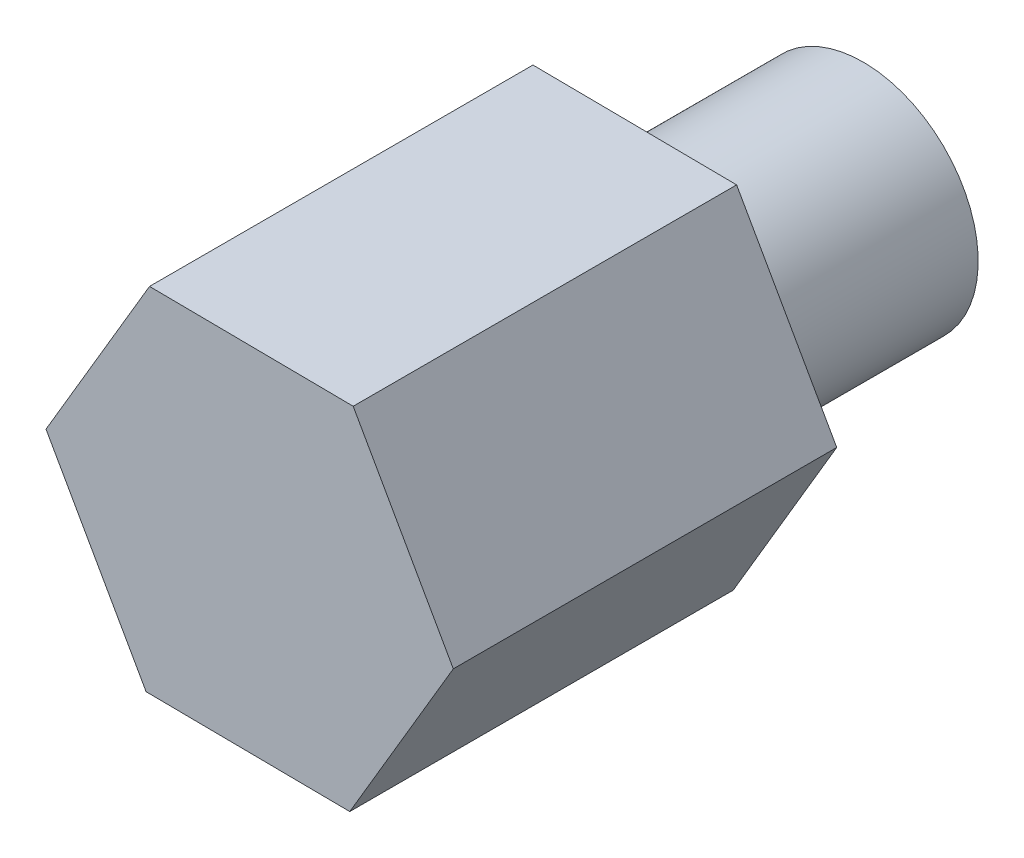
ISO-10303-21;
HEADER;
FILE_DESCRIPTION(('STEP AP214'),'2;1');
FILE_NAME('part.step','',(''),(''),'','','');
FILE_SCHEMA(('AUTOMOTIVE_DESIGN { 1 0 10303 214 1 1 1 1 }'));
ENDSEC;
DATA;
#1=APPLICATION_CONTEXT('core data for automotive mechanical design processes');
#2=APPLICATION_PROTOCOL_DEFINITION('international standard','automotive_design',2000,#1);
#3=PRODUCT_CONTEXT('',#1,'mechanical');
#4=PRODUCT('Part','Part','',(#3));
#5=PRODUCT_RELATED_PRODUCT_CATEGORY('part','',(#4));
#6=PRODUCT_DEFINITION_FORMATION('','',#4);
#7=PRODUCT_DEFINITION_CONTEXT('part definition',#1,'design');
#8=PRODUCT_DEFINITION('design','',#6,#7);
#9=PRODUCT_DEFINITION_SHAPE('','',#8);
#10=(LENGTH_UNIT() NAMED_UNIT(*) SI_UNIT(.MILLI.,.METRE.));
#11=(NAMED_UNIT(*) PLANE_ANGLE_UNIT() SI_UNIT($,.RADIAN.));
#12=(NAMED_UNIT(*) SI_UNIT($,.STERADIAN.) SOLID_ANGLE_UNIT());
#13=UNCERTAINTY_MEASURE_WITH_UNIT(LENGTH_MEASURE(1.E-05),#10,'distance_accuracy_value','');
#14=(GEOMETRIC_REPRESENTATION_CONTEXT(3) GLOBAL_UNCERTAINTY_ASSIGNED_CONTEXT((#13)) GLOBAL_UNIT_ASSIGNED_CONTEXT((#10,
#11,#12)) REPRESENTATION_CONTEXT('',''));
#15=CARTESIAN_POINT('',(0.,0.,0.));
#16=DIRECTION('',(0.,0.,1.));
#17=DIRECTION('',(1.,0.,0.));
#18=AXIS2_PLACEMENT_3D('',#15,#16,#17);
#19=CARTESIAN_POINT('',(-1.35012806829189,-2.28702591427027,5.));
#20=DIRECTION('',(0.0096890351231425,0.999953060197519,0.));
#21=DIRECTION('',(-0.999953060197519,0.0096890351231425,0.));
#22=AXIS2_PLACEMENT_3D('',#19,#20,#21);
#23=PLANE('',#22);
#24=DIRECTION('',(0.999953060197519,-0.0096890351231425,0.));
#25=VECTOR('',#24,1.);
#26=CARTESIAN_POINT('',(-1.35012806829189,-2.28702591427027,0.));
#27=LINE('',#26,#25);
#28=CARTESIAN_POINT('',(-1.35012806829189,-2.28702591427027,0.));
#29=VERTEX_POINT('',#28);
#30=CARTESIAN_POINT('',(1.30555850672544,-2.31275816263832,0.));
#31=VERTEX_POINT('',#30);
#32=EDGE_CURVE('E119',#29,#31,#27,.T.);
#33=ORIENTED_EDGE('',*,*,#32,.T.);
#34=DIRECTION('',(0.,0.,-1.));
#35=VECTOR('',#34,1.);
#36=CARTESIAN_POINT('',(1.30555850672544,-2.31275816263832,5.));
#37=LINE('',#36,#35);
#38=CARTESIAN_POINT('',(1.30555850672544,-2.31275816263832,5.));
#39=VERTEX_POINT('',#38);
#40=EDGE_CURVE('E36',#39,#31,#37,.T.);
#41=ORIENTED_EDGE('',*,*,#40,.F.);
#42=DIRECTION('',(0.999953060197519,-0.0096890351231425,0.));
#43=VECTOR('',#42,1.);
#44=CARTESIAN_POINT('',(-1.35012806829189,-2.28702591427027,5.));
#45=LINE('',#44,#43);
#46=CARTESIAN_POINT('',(-1.35012806829189,-2.28702591427027,5.));
#47=VERTEX_POINT('',#46);
#48=EDGE_CURVE('E130',#47,#39,#45,.T.);
#49=ORIENTED_EDGE('',*,*,#48,.F.);
#50=DIRECTION('',(0.,0.,-1.));
#51=VECTOR('',#50,1.);
#52=CARTESIAN_POINT('',(-1.35012806829189,-2.28702591427027,5.));
#53=LINE('',#52,#51);
#54=EDGE_CURVE('E115',#47,#29,#53,.T.);
#55=ORIENTED_EDGE('',*,*,#54,.T.);
#56=EDGE_LOOP('',(#33,#41,#49,#55));
#57=FACE_BOUND('',#56,.T.);
#58=ADVANCED_FACE('F33',(#57),#23,.F.);
#59=CARTESIAN_POINT('',(1.30555850672544,-2.31275816263832,5.));
#60=DIRECTION('',(-0.86114023516147,0.508367480653561,0.));
#61=DIRECTION('',(-0.508367480653561,-0.86114023516147,0.));
#62=AXIS2_PLACEMENT_3D('',#59,#60,#61);
#63=PLANE('',#62);
#64=DIRECTION('',(0.508367480653561,0.86114023516147,0.));
#65=VECTOR('',#64,1.);
#66=CARTESIAN_POINT('',(1.30555850672544,-2.31275816263832,0.));
#67=LINE('',#66,#65);
#68=CARTESIAN_POINT('',(2.65568657501733,-0.0257322483680573,0.));
#69=VERTEX_POINT('',#68);
#70=EDGE_CURVE('E122',#31,#69,#67,.T.);
#71=ORIENTED_EDGE('',*,*,#70,.T.);
#72=DIRECTION('',(0.,0.,-1.));
#73=VECTOR('',#72,1.);
#74=CARTESIAN_POINT('',(2.65568657501733,-0.0257322483680573,5.));
#75=LINE('',#74,#73);
#76=CARTESIAN_POINT('',(2.65568657501733,-0.0257322483680573,5.));
#77=VERTEX_POINT('',#76);
#78=EDGE_CURVE('E133',#77,#69,#75,.T.);
#79=ORIENTED_EDGE('',*,*,#78,.F.);
#80=DIRECTION('',(0.508367480653561,0.86114023516147,0.));
#81=VECTOR('',#80,1.);
#82=CARTESIAN_POINT('',(1.30555850672544,-2.31275816263832,5.));
#83=LINE('',#82,#81);
#84=EDGE_CURVE('E88',#39,#77,#83,.T.);
#85=ORIENTED_EDGE('',*,*,#84,.F.);
#86=ORIENTED_EDGE('',*,*,#40,.T.);
#87=EDGE_LOOP('',(#71,#79,#85,#86));
#88=FACE_BOUND('',#87,.T.);
#89=ADVANCED_FACE('F138',(#88),#63,.F.);
#90=CARTESIAN_POINT('',(2.65568657501733,-0.0257322483680573,5.));
#91=DIRECTION('',(-0.870829270284612,-0.491585579543959,0.));
#92=DIRECTION('',(0.491585579543959,-0.870829270284612,0.));
#93=AXIS2_PLACEMENT_3D('',#90,#91,#92);
#94=PLANE('',#93);
#95=DIRECTION('',(-0.491585579543959,0.870829270284612,0.));
#96=VECTOR('',#95,1.);
#97=CARTESIAN_POINT('',(2.65568657501733,-0.0257322483680573,0.));
#98=LINE('',#97,#96);
#99=CARTESIAN_POINT('',(1.35012806829189,2.28702591427027,0.));
#100=VERTEX_POINT('',#99);
#101=EDGE_CURVE('E125',#69,#100,#98,.T.);
#102=ORIENTED_EDGE('',*,*,#101,.T.);
#103=DIRECTION('',(0.,0.,-1.));
#104=VECTOR('',#103,1.);
#105=CARTESIAN_POINT('',(1.35012806829189,2.28702591427027,5.));
#106=LINE('',#105,#104);
#107=CARTESIAN_POINT('',(1.35012806829189,2.28702591427027,5.));
#108=VERTEX_POINT('',#107);
#109=EDGE_CURVE('E110',#108,#100,#106,.T.);
#110=ORIENTED_EDGE('',*,*,#109,.F.);
#111=DIRECTION('',(-0.491585579543959,0.870829270284612,0.));
#112=VECTOR('',#111,1.);
#113=CARTESIAN_POINT('',(2.65568657501733,-0.0257322483680573,5.));
#114=LINE('',#113,#112);
#115=EDGE_CURVE('E101',#77,#108,#114,.T.);
#116=ORIENTED_EDGE('',*,*,#115,.F.);
#117=ORIENTED_EDGE('',*,*,#78,.T.);
#118=EDGE_LOOP('',(#102,#110,#116,#117));
#119=FACE_BOUND('',#118,.T.);
#120=ADVANCED_FACE('F144',(#119),#94,.F.);
#121=CARTESIAN_POINT('',(1.35012806829189,2.28702591427027,5.));
#122=DIRECTION('',(-0.00968903512314233,-0.999953060197519,0.));
#123=DIRECTION('',(0.999953060197519,-0.00968903512314233,0.));
#124=AXIS2_PLACEMENT_3D('',#121,#122,#123);
#125=PLANE('',#124);
#126=DIRECTION('',(-0.999953060197519,0.00968903512314233,0.));
#127=VECTOR('',#126,1.);
#128=CARTESIAN_POINT('',(1.35012806829189,2.28702591427027,0.));
#129=LINE('',#128,#127);
#130=CARTESIAN_POINT('',(-1.30555850672544,2.31275816263832,0.));
#131=VERTEX_POINT('',#130);
#132=EDGE_CURVE('E109',#100,#131,#129,.T.);
#133=ORIENTED_EDGE('',*,*,#132,.T.);
#134=DIRECTION('',(0.,0.,-1.));
#135=VECTOR('',#134,1.);
#136=CARTESIAN_POINT('',(-1.30555850672544,2.31275816263832,5.));
#137=LINE('',#136,#135);
#138=CARTESIAN_POINT('',(-1.30555850672544,2.31275816263832,5.));
#139=VERTEX_POINT('',#138);
#140=EDGE_CURVE('E106',#139,#131,#137,.T.);
#141=ORIENTED_EDGE('',*,*,#140,.F.);
#142=DIRECTION('',(-0.999953060197519,0.00968903512314233,0.));
#143=VECTOR('',#142,1.);
#144=CARTESIAN_POINT('',(1.35012806829189,2.28702591427027,5.));
#145=LINE('',#144,#143);
#146=EDGE_CURVE('E95',#108,#139,#145,.T.);
#147=ORIENTED_EDGE('',*,*,#146,.F.);
#148=ORIENTED_EDGE('',*,*,#109,.T.);
#149=EDGE_LOOP('',(#133,#141,#147,#148));
#150=FACE_BOUND('',#149,.T.);
#151=ADVANCED_FACE('F107',(#150),#125,.F.);
#152=CARTESIAN_POINT('',(-1.30555850672544,2.31275816263832,5.));
#153=DIRECTION('',(0.86114023516147,-0.508367480653561,0.));
#154=DIRECTION('',(0.508367480653561,0.86114023516147,0.));
#155=AXIS2_PLACEMENT_3D('',#152,#153,#154);
#156=PLANE('',#155);
#157=DIRECTION('',(-0.508367480653561,-0.86114023516147,0.));
#158=VECTOR('',#157,1.);
#159=CARTESIAN_POINT('',(-1.30555850672544,2.31275816263832,0.));
#160=LINE('',#159,#158);
#161=CARTESIAN_POINT('',(-2.65568657501733,0.0257322483680568,0.));
#162=VERTEX_POINT('',#161);
#163=EDGE_CURVE('E73',#131,#162,#160,.T.);
#164=ORIENTED_EDGE('',*,*,#163,.T.);
#165=DIRECTION('',(0.,0.,-1.));
#166=VECTOR('',#165,1.);
#167=CARTESIAN_POINT('',(-2.65568657501733,0.0257322483680568,5.));
#168=LINE('',#167,#166);
#169=CARTESIAN_POINT('',(-2.65568657501733,0.0257322483680568,5.));
#170=VERTEX_POINT('',#169);
#171=EDGE_CURVE('E111',#170,#162,#168,.T.);
#172=ORIENTED_EDGE('',*,*,#171,.F.);
#173=DIRECTION('',(-0.508367480653561,-0.86114023516147,0.));
#174=VECTOR('',#173,1.);
#175=CARTESIAN_POINT('',(-1.30555850672544,2.31275816263832,5.));
#176=LINE('',#175,#174);
#177=EDGE_CURVE('E99',#139,#170,#176,.T.);
#178=ORIENTED_EDGE('',*,*,#177,.F.);
#179=ORIENTED_EDGE('',*,*,#140,.T.);
#180=EDGE_LOOP('',(#164,#172,#178,#179));
#181=FACE_BOUND('',#180,.T.);
#182=ADVANCED_FACE('F113',(#181),#156,.F.);
#183=CARTESIAN_POINT('',(-2.65568657501733,0.0257322483680568,5.));
#184=DIRECTION('',(0.870829270284612,0.491585579543958,0.));
#185=DIRECTION('',(-0.491585579543958,0.870829270284612,0.));
#186=AXIS2_PLACEMENT_3D('',#183,#184,#185);
#187=PLANE('',#186);
#188=DIRECTION('',(0.491585579543959,-0.870829270284612,0.));
#189=VECTOR('',#188,1.);
#190=CARTESIAN_POINT('',(-2.65568657501733,0.0257322483680568,0.));
#191=LINE('',#190,#189);
#192=EDGE_CURVE('E79',#162,#29,#191,.T.);
#193=ORIENTED_EDGE('',*,*,#192,.T.);
#194=ORIENTED_EDGE('',*,*,#54,.F.);
#195=DIRECTION('',(0.491585579543959,-0.870829270284612,0.));
#196=VECTOR('',#195,1.);
#197=CARTESIAN_POINT('',(-2.65568657501733,0.0257322483680568,5.));
#198=LINE('',#197,#196);
#199=EDGE_CURVE('E50',#170,#47,#198,.T.);
#200=ORIENTED_EDGE('',*,*,#199,.F.);
#201=ORIENTED_EDGE('',*,*,#171,.T.);
#202=EDGE_LOOP('',(#193,#194,#200,#201));
#203=FACE_BOUND('',#202,.T.);
#204=ADVANCED_FACE('F164',(#203),#187,.F.);
#205=CARTESIAN_POINT('',(0.,0.,5.));
#206=DIRECTION('',(0.,0.,1.));
#207=DIRECTION('',(1.,0.,0.));
#208=AXIS2_PLACEMENT_3D('',#205,#206,#207);
#209=PLANE('',#208);
#210=ORIENTED_EDGE('',*,*,#48,.T.);
#211=ORIENTED_EDGE('',*,*,#84,.T.);
#212=ORIENTED_EDGE('',*,*,#115,.T.);
#213=ORIENTED_EDGE('',*,*,#146,.T.);
#214=ORIENTED_EDGE('',*,*,#177,.T.);
#215=ORIENTED_EDGE('',*,*,#199,.T.);
#216=EDGE_LOOP('',(#210,#211,#212,#213,#214,#215));
#217=FACE_BOUND('',#216,.T.);
#218=ADVANCED_FACE('F97',(#217),#209,.T.);
#219=CARTESIAN_POINT('',(0.,0.,0.));
#220=DIRECTION('',(0.,0.,1.));
#221=DIRECTION('',(1.,0.,0.));
#222=AXIS2_PLACEMENT_3D('',#219,#220,#221);
#223=PLANE('',#222);
#224=CARTESIAN_POINT('',(0.,0.,0.));
#225=DIRECTION('',(0.,0.,-1.));
#226=DIRECTION('',(-1.,0.,0.));
#227=AXIS2_PLACEMENT_3D('',#224,#225,#226);
#228=CIRCLE('',#227,1.5);
#229=CARTESIAN_POINT('',(-1.5,0.,0.));
#230=VERTEX_POINT('',#229);
#231=EDGE_CURVE('E11',#230,#230,#228,.T.);
#232=ORIENTED_EDGE('',*,*,#231,.F.);
#233=EDGE_LOOP('',(#232));
#234=FACE_BOUND('',#233,.T.);
#235=ORIENTED_EDGE('',*,*,#32,.F.);
#236=ORIENTED_EDGE('',*,*,#192,.F.);
#237=ORIENTED_EDGE('',*,*,#163,.F.);
#238=ORIENTED_EDGE('',*,*,#132,.F.);
#239=ORIENTED_EDGE('',*,*,#101,.F.);
#240=ORIENTED_EDGE('',*,*,#70,.F.);
#241=EDGE_LOOP('',(#235,#236,#237,#238,#239,#240));
#242=FACE_BOUND('',#241,.T.);
#243=ADVANCED_FACE('F143',(#234,#242),#223,.F.);
#244=CARTESIAN_POINT('',(0.,0.,-3.));
#245=DIRECTION('',(0.,0.,1.));
#246=DIRECTION('',(1.,0.,0.));
#247=AXIS2_PLACEMENT_3D('',#244,#245,#246);
#248=CYLINDRICAL_SURFACE('',#247,1.5);
#249=CARTESIAN_POINT('',(0.,0.,-3.));
#250=DIRECTION('',(0.,0.,-1.));
#251=DIRECTION('',(-1.,0.,0.));
#252=AXIS2_PLACEMENT_3D('',#249,#250,#251);
#253=CIRCLE('',#252,1.5);
#254=CARTESIAN_POINT('',(-1.5,0.,-3.));
#255=VERTEX_POINT('',#254);
#256=EDGE_CURVE('E123',#255,#255,#253,.T.);
#257=ORIENTED_EDGE('',*,*,#256,.F.);
#258=EDGE_LOOP('',(#257));
#259=FACE_BOUND('',#258,.T.);
#260=ORIENTED_EDGE('',*,*,#231,.T.);
#261=EDGE_LOOP('',(#260));
#262=FACE_BOUND('',#261,.T.);
#263=ADVANCED_FACE('F153',(#259,#262),#248,.T.);
#264=CARTESIAN_POINT('',(0.,0.,-3.));
#265=DIRECTION('',(0.,0.,-1.));
#266=DIRECTION('',(-1.,0.,0.));
#267=AXIS2_PLACEMENT_3D('',#264,#265,#266);
#268=PLANE('',#267);
#269=ORIENTED_EDGE('',*,*,#256,.T.);
#270=EDGE_LOOP('',(#269));
#271=FACE_BOUND('',#270,.T.);
#272=ADVANCED_FACE('F151',(#271),#268,.T.);
#273=CLOSED_SHELL('',(#58,#89,#120,#151,#182,#204,#218,#243,#263,#272));
#274=MANIFOLD_SOLID_BREP('B2',#273);
#275=ADVANCED_BREP_SHAPE_REPRESENTATION('',(#18,#274),#14);
#276=SHAPE_DEFINITION_REPRESENTATION(#9,#275);
ENDSEC;
END-ISO-10303-21;
